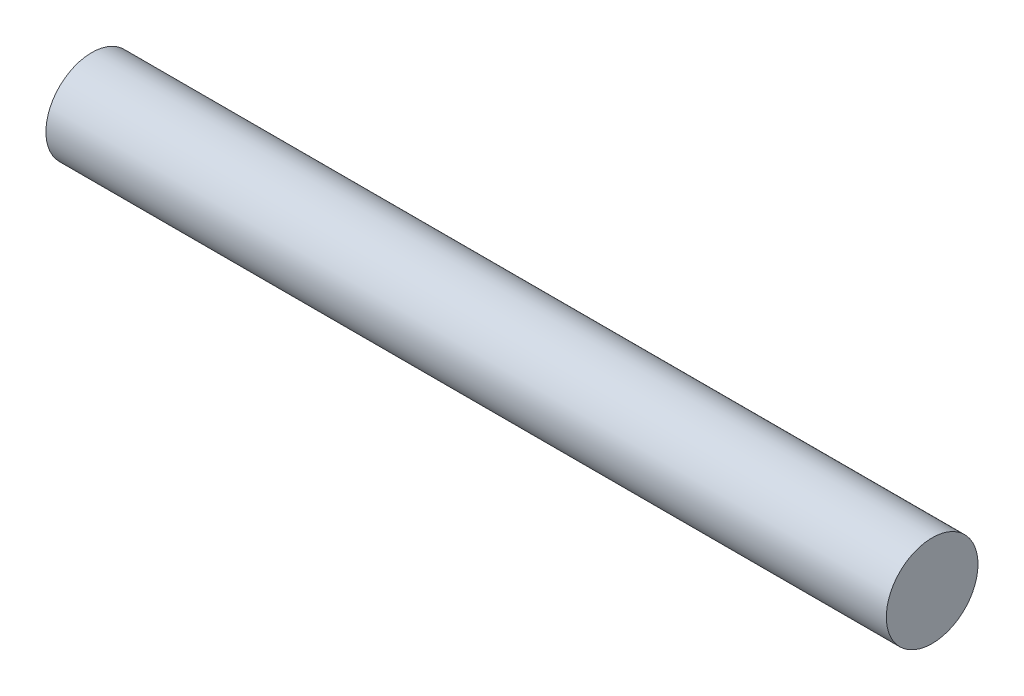
ISO-10303-21;
HEADER;
FILE_DESCRIPTION(('STEP AP214'),'2;1');
FILE_NAME('part.step','',(''),(''),'','','');
FILE_SCHEMA(('AUTOMOTIVE_DESIGN { 1 0 10303 214 1 1 1 1 }'));
ENDSEC;
DATA;
#1=APPLICATION_CONTEXT('core data for automotive mechanical design processes');
#2=APPLICATION_PROTOCOL_DEFINITION('international standard','automotive_design',2000,#1);
#3=PRODUCT_CONTEXT('',#1,'mechanical');
#4=PRODUCT('Part','Part','',(#3));
#5=PRODUCT_RELATED_PRODUCT_CATEGORY('part','',(#4));
#6=PRODUCT_DEFINITION_FORMATION('','',#4);
#7=PRODUCT_DEFINITION_CONTEXT('part definition',#1,'design');
#8=PRODUCT_DEFINITION('design','',#6,#7);
#9=PRODUCT_DEFINITION_SHAPE('','',#8);
#10=(LENGTH_UNIT() NAMED_UNIT(*) SI_UNIT(.MILLI.,.METRE.));
#11=(NAMED_UNIT(*) PLANE_ANGLE_UNIT() SI_UNIT($,.RADIAN.));
#12=(NAMED_UNIT(*) SI_UNIT($,.STERADIAN.) SOLID_ANGLE_UNIT());
#13=UNCERTAINTY_MEASURE_WITH_UNIT(LENGTH_MEASURE(1.E-05),#10,'distance_accuracy_value','');
#14=(GEOMETRIC_REPRESENTATION_CONTEXT(3) GLOBAL_UNCERTAINTY_ASSIGNED_CONTEXT((#13)) GLOBAL_UNIT_ASSIGNED_CONTEXT((#10,
#11,#12)) REPRESENTATION_CONTEXT('',''));
#15=CARTESIAN_POINT('',(0.,0.,0.));
#16=DIRECTION('',(0.,0.,1.));
#17=DIRECTION('',(1.,0.,0.));
#18=AXIS2_PLACEMENT_3D('',#15,#16,#17);
#19=CARTESIAN_POINT('',(11.,0.,0.));
#20=DIRECTION('',(-1.,0.,0.));
#21=DIRECTION('',(0.,0.,1.));
#22=AXIS2_PLACEMENT_3D('',#19,#20,#21);
#23=CYLINDRICAL_SURFACE('',#22,0.6);
#24=CARTESIAN_POINT('',(11.,0.,0.));
#25=DIRECTION('',(1.,0.,0.));
#26=DIRECTION('',(0.,0.,-1.));
#27=AXIS2_PLACEMENT_3D('',#24,#25,#26);
#28=CIRCLE('',#27,0.6);
#29=CARTESIAN_POINT('',(11.,0.,-0.6));
#30=VERTEX_POINT('',#29);
#31=EDGE_CURVE('E10',#30,#30,#28,.T.);
#32=ORIENTED_EDGE('',*,*,#31,.F.);
#33=EDGE_LOOP('',(#32));
#34=FACE_BOUND('',#33,.T.);
#35=CARTESIAN_POINT('',(0.,0.,0.));
#36=DIRECTION('',(1.,0.,0.));
#37=DIRECTION('',(0.,0.,-1.));
#38=AXIS2_PLACEMENT_3D('',#35,#36,#37);
#39=CIRCLE('',#38,0.6);
#40=CARTESIAN_POINT('',(0.,0.,-0.6));
#41=VERTEX_POINT('',#40);
#42=EDGE_CURVE('E34',#41,#41,#39,.T.);
#43=ORIENTED_EDGE('',*,*,#42,.T.);
#44=EDGE_LOOP('',(#43));
#45=FACE_BOUND('',#44,.T.);
#46=ADVANCED_FACE('F31',(#34,#45),#23,.T.);
#47=CARTESIAN_POINT('',(11.,0.,0.));
#48=DIRECTION('',(1.,0.,0.));
#49=DIRECTION('',(0.,0.,-1.));
#50=AXIS2_PLACEMENT_3D('',#47,#48,#49);
#51=PLANE('',#50);
#52=ORIENTED_EDGE('',*,*,#31,.T.);
#53=EDGE_LOOP('',(#52));
#54=FACE_BOUND('',#53,.T.);
#55=ADVANCED_FACE('F46',(#54),#51,.T.);
#56=CARTESIAN_POINT('',(0.,0.,0.));
#57=DIRECTION('',(1.,0.,0.));
#58=DIRECTION('',(0.,0.,-1.));
#59=AXIS2_PLACEMENT_3D('',#56,#57,#58);
#60=PLANE('',#59);
#61=ORIENTED_EDGE('',*,*,#42,.F.);
#62=EDGE_LOOP('',(#61));
#63=FACE_BOUND('',#62,.T.);
#64=ADVANCED_FACE('F44',(#63),#60,.F.);
#65=CLOSED_SHELL('',(#46,#55,#64));
#66=MANIFOLD_SOLID_BREP('B2',#65);
#67=ADVANCED_BREP_SHAPE_REPRESENTATION('',(#18,#66),#14);
#68=SHAPE_DEFINITION_REPRESENTATION(#9,#67);
ENDSEC;
END-ISO-10303-21;
